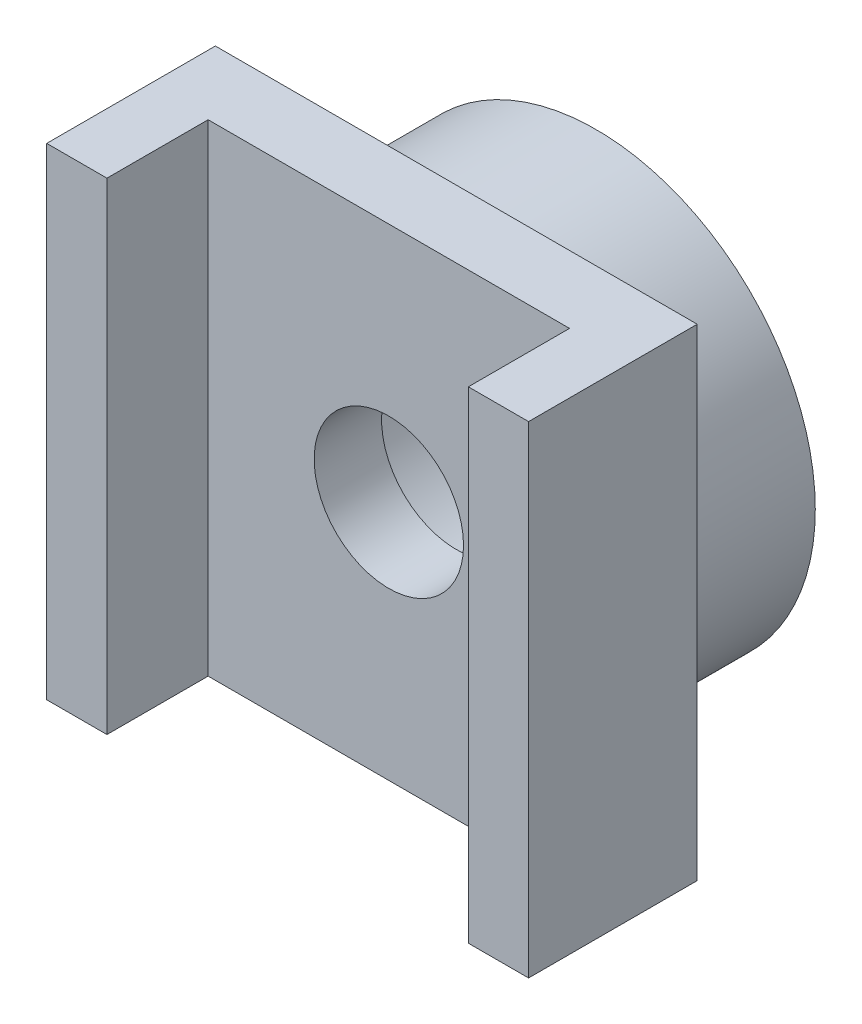
ISO-10303-21;
HEADER;
FILE_DESCRIPTION(('STEP AP214'),'2;1');
FILE_NAME('part.step','',(''),(''),'','','');
FILE_SCHEMA(('AUTOMOTIVE_DESIGN { 1 0 10303 214 1 1 1 1 }'));
ENDSEC;
DATA;
#1=APPLICATION_CONTEXT('core data for automotive mechanical design processes');
#2=APPLICATION_PROTOCOL_DEFINITION('international standard','automotive_design',2000,#1);
#3=PRODUCT_CONTEXT('',#1,'mechanical');
#4=PRODUCT('Part','Part','',(#3));
#5=PRODUCT_RELATED_PRODUCT_CATEGORY('part','',(#4));
#6=PRODUCT_DEFINITION_FORMATION('','',#4);
#7=PRODUCT_DEFINITION_CONTEXT('part definition',#1,'design');
#8=PRODUCT_DEFINITION('design','',#6,#7);
#9=PRODUCT_DEFINITION_SHAPE('','',#8);
#10=(LENGTH_UNIT() NAMED_UNIT(*) SI_UNIT(.MILLI.,.METRE.));
#11=(NAMED_UNIT(*) PLANE_ANGLE_UNIT() SI_UNIT($,.RADIAN.));
#12=(NAMED_UNIT(*) SI_UNIT($,.STERADIAN.) SOLID_ANGLE_UNIT());
#13=UNCERTAINTY_MEASURE_WITH_UNIT(LENGTH_MEASURE(1.E-05),#10,'distance_accuracy_value','');
#14=(GEOMETRIC_REPRESENTATION_CONTEXT(3) GLOBAL_UNCERTAINTY_ASSIGNED_CONTEXT((#13)) GLOBAL_UNIT_ASSIGNED_CONTEXT((#10,
#11,#12)) REPRESENTATION_CONTEXT('',''));
#15=CARTESIAN_POINT('',(0.,0.,0.));
#16=DIRECTION('',(0.,0.,1.));
#17=DIRECTION('',(1.,0.,0.));
#18=AXIS2_PLACEMENT_3D('',#15,#16,#17);
#19=CARTESIAN_POINT('',(0.,0.,0.));
#20=DIRECTION('',(0.,0.,1.));
#21=DIRECTION('',(1.,0.,0.));
#22=AXIS2_PLACEMENT_3D('',#19,#20,#21);
#23=PLANE('',#22);
#24=CARTESIAN_POINT('',(0.,0.,0.));
#25=DIRECTION('',(0.,0.,1.));
#26=DIRECTION('',(1.,0.,0.));
#27=AXIS2_PLACEMENT_3D('',#24,#25,#26);
#28=CIRCLE('',#27,4.55);
#29=CARTESIAN_POINT('',(4.55,0.,0.));
#30=VERTEX_POINT('',#29);
#31=EDGE_CURVE('E41',#30,#30,#28,.T.);
#32=ORIENTED_EDGE('',*,*,#31,.F.);
#33=EDGE_LOOP('',(#32));
#34=FACE_BOUND('',#33,.T.);
#35=CARTESIAN_POINT('',(0.,0.,0.));
#36=DIRECTION('',(0.,0.,1.));
#37=DIRECTION('',(1.,0.,0.));
#38=AXIS2_PLACEMENT_3D('',#35,#36,#37);
#39=CIRCLE('',#38,2.8);
#40=CARTESIAN_POINT('',(2.8,0.,0.));
#41=VERTEX_POINT('',#40);
#42=EDGE_CURVE('E184',#41,#41,#39,.T.);
#43=ORIENTED_EDGE('',*,*,#42,.T.);
#44=EDGE_LOOP('',(#43));
#45=FACE_BOUND('',#44,.T.);
#46=ADVANCED_FACE('F32',(#34,#45),#23,.F.);
#47=CARTESIAN_POINT('',(0.,0.,2.9));
#48=DIRECTION('',(0.,0.,-1.));
#49=DIRECTION('',(-1.,0.,0.));
#50=AXIS2_PLACEMENT_3D('',#47,#48,#49);
#51=CYLINDRICAL_SURFACE('',#50,4.55);
#52=CARTESIAN_POINT('',(0.,0.,2.9));
#53=DIRECTION('',(0.,0.,1.));
#54=DIRECTION('',(1.,0.,0.));
#55=AXIS2_PLACEMENT_3D('',#52,#53,#54);
#56=CIRCLE('',#55,4.55);
#57=CARTESIAN_POINT('',(4.55,0.,2.9));
#58=VERTEX_POINT('',#57);
#59=EDGE_CURVE('E11',#58,#58,#56,.T.);
#60=ORIENTED_EDGE('',*,*,#59,.F.);
#61=EDGE_LOOP('',(#60));
#62=FACE_BOUND('',#61,.T.);
#63=ORIENTED_EDGE('',*,*,#31,.T.);
#64=EDGE_LOOP('',(#63));
#65=FACE_BOUND('',#64,.T.);
#66=ADVANCED_FACE('F34',(#62,#65),#51,.T.);
#67=CARTESIAN_POINT('',(0.,0.,2.9));
#68=DIRECTION('',(0.,0.,-1.));
#69=DIRECTION('',(-1.,0.,0.));
#70=AXIS2_PLACEMENT_3D('',#67,#68,#69);
#71=CYLINDRICAL_SURFACE('',#70,2.8);
#72=CARTESIAN_POINT('',(0.,0.,2.9));
#73=DIRECTION('',(0.,0.,1.));
#74=DIRECTION('',(1.,0.,0.));
#75=AXIS2_PLACEMENT_3D('',#72,#73,#74);
#76=CIRCLE('',#75,2.8);
#77=CARTESIAN_POINT('',(2.8,0.,2.9));
#78=VERTEX_POINT('',#77);
#79=EDGE_CURVE('E181',#78,#78,#76,.T.);
#80=ORIENTED_EDGE('',*,*,#79,.T.);
#81=EDGE_LOOP('',(#80));
#82=FACE_BOUND('',#81,.T.);
#83=ORIENTED_EDGE('',*,*,#42,.F.);
#84=EDGE_LOOP('',(#83));
#85=FACE_BOUND('',#84,.T.);
#86=ADVANCED_FACE('F216',(#82,#85),#71,.F.);
#87=CARTESIAN_POINT('',(0.,-11.1414213562373,2.9));
#88=DIRECTION('',(0.,0.,1.));
#89=DIRECTION('',(1.,0.,0.));
#90=AXIS2_PLACEMENT_3D('',#87,#88,#89);
#91=PLANE('',#90);
#92=DIRECTION('',(1.,0.,0.));
#93=VECTOR('',#92,1.);
#94=CARTESIAN_POINT('',(0.,-5.,2.9));
#95=LINE('',#94,#93);
#96=CARTESIAN_POINT('',(-5.,-5.,2.9));
#97=VERTEX_POINT('',#96);
#98=CARTESIAN_POINT('',(5.,-5.,2.9));
#99=VERTEX_POINT('',#98);
#100=EDGE_CURVE('E155',#97,#99,#95,.T.);
#101=ORIENTED_EDGE('',*,*,#100,.F.);
#102=DIRECTION('',(0.,1.,0.));
#103=VECTOR('',#102,1.);
#104=CARTESIAN_POINT('',(-5.,-11.1414213562373,2.9));
#105=LINE('',#104,#103);
#106=CARTESIAN_POINT('',(-5.,5.,2.9));
#107=VERTEX_POINT('',#106);
#108=EDGE_CURVE('E168',#97,#107,#105,.T.);
#109=ORIENTED_EDGE('',*,*,#108,.T.);
#110=DIRECTION('',(1.,0.,0.));
#111=VECTOR('',#110,1.);
#112=CARTESIAN_POINT('',(0.,5.,2.9));
#113=LINE('',#112,#111);
#114=CARTESIAN_POINT('',(5.,5.,2.9));
#115=VERTEX_POINT('',#114);
#116=EDGE_CURVE('E161',#107,#115,#113,.T.);
#117=ORIENTED_EDGE('',*,*,#116,.T.);
#118=DIRECTION('',(0.,1.,0.));
#119=VECTOR('',#118,1.);
#120=CARTESIAN_POINT('',(5.,-11.1414213562373,2.9));
#121=LINE('',#120,#119);
#122=EDGE_CURVE('E158',#99,#115,#121,.T.);
#123=ORIENTED_EDGE('',*,*,#122,.F.);
#124=EDGE_LOOP('',(#101,#109,#117,#123));
#125=FACE_BOUND('',#124,.T.);
#126=ORIENTED_EDGE('',*,*,#59,.T.);
#127=EDGE_LOOP('',(#126));
#128=FACE_BOUND('',#127,.T.);
#129=ADVANCED_FACE('F207',(#125,#128),#91,.F.);
#130=CARTESIAN_POINT('',(0.,-5.,4.3));
#131=DIRECTION('',(0.,1.,0.));
#132=DIRECTION('',(0.,0.,1.));
#133=AXIS2_PLACEMENT_3D('',#130,#131,#132);
#134=PLANE('',#133);
#135=ORIENTED_EDGE('',*,*,#100,.T.);
#136=DIRECTION('',(0.,0.,-1.));
#137=VECTOR('',#136,1.);
#138=CARTESIAN_POINT('',(5.,-5.,4.3));
#139=LINE('',#138,#137);
#140=CARTESIAN_POINT('',(5.,-5.,6.4));
#141=VERTEX_POINT('',#140);
#142=EDGE_CURVE('E122',#141,#99,#139,.T.);
#143=ORIENTED_EDGE('',*,*,#142,.F.);
#144=DIRECTION('',(-1.,0.,0.));
#145=VECTOR('',#144,1.);
#146=CARTESIAN_POINT('',(-11.1414213562373,-5.,6.4));
#147=LINE('',#146,#145);
#148=CARTESIAN_POINT('',(3.75,-5.,6.4));
#149=VERTEX_POINT('',#148);
#150=EDGE_CURVE('E114',#141,#149,#147,.T.);
#151=ORIENTED_EDGE('',*,*,#150,.T.);
#152=DIRECTION('',(0.,0.,-1.));
#153=VECTOR('',#152,1.);
#154=CARTESIAN_POINT('',(3.75,-5.,6.4));
#155=LINE('',#154,#153);
#156=CARTESIAN_POINT('',(3.75,-5.,4.3));
#157=VERTEX_POINT('',#156);
#158=EDGE_CURVE('E101',#149,#157,#155,.T.);
#159=ORIENTED_EDGE('',*,*,#158,.T.);
#160=DIRECTION('',(1.,0.,0.));
#161=VECTOR('',#160,1.);
#162=CARTESIAN_POINT('',(0.,-5.,4.3));
#163=LINE('',#162,#161);
#164=CARTESIAN_POINT('',(-3.75,-5.,4.3));
#165=VERTEX_POINT('',#164);
#166=EDGE_CURVE('E174',#165,#157,#163,.T.);
#167=ORIENTED_EDGE('',*,*,#166,.F.);
#168=DIRECTION('',(0.,0.,-1.));
#169=VECTOR('',#168,1.);
#170=CARTESIAN_POINT('',(-3.75,-5.,6.4));
#171=LINE('',#170,#169);
#172=CARTESIAN_POINT('',(-3.75,-5.,6.4));
#173=VERTEX_POINT('',#172);
#174=EDGE_CURVE('E152',#173,#165,#171,.T.);
#175=ORIENTED_EDGE('',*,*,#174,.F.);
#176=DIRECTION('',(-1.,0.,0.));
#177=VECTOR('',#176,1.);
#178=CARTESIAN_POINT('',(-11.1414213562373,-5.,6.4));
#179=LINE('',#178,#177);
#180=CARTESIAN_POINT('',(-5.,-5.,6.4));
#181=VERTEX_POINT('',#180);
#182=EDGE_CURVE('E130',#173,#181,#179,.T.);
#183=ORIENTED_EDGE('',*,*,#182,.T.);
#184=DIRECTION('',(0.,0.,-1.));
#185=VECTOR('',#184,1.);
#186=CARTESIAN_POINT('',(-5.,-5.,4.3));
#187=LINE('',#186,#185);
#188=EDGE_CURVE('E57',#181,#97,#187,.T.);
#189=ORIENTED_EDGE('',*,*,#188,.T.);
#190=EDGE_LOOP('',(#135,#143,#151,#159,#167,#175,#183,#189));
#191=FACE_BOUND('',#190,.T.);
#192=ADVANCED_FACE('F120',(#191),#134,.F.);
#193=CARTESIAN_POINT('',(5.,-11.1414213562373,4.3));
#194=DIRECTION('',(-1.,0.,0.));
#195=DIRECTION('',(0.,0.,1.));
#196=AXIS2_PLACEMENT_3D('',#193,#194,#195);
#197=PLANE('',#196);
#198=ORIENTED_EDGE('',*,*,#122,.T.);
#199=DIRECTION('',(0.,0.,-1.));
#200=VECTOR('',#199,1.);
#201=CARTESIAN_POINT('',(5.,5.,4.3));
#202=LINE('',#201,#200);
#203=CARTESIAN_POINT('',(5.,5.,6.4));
#204=VERTEX_POINT('',#203);
#205=EDGE_CURVE('E178',#204,#115,#202,.T.);
#206=ORIENTED_EDGE('',*,*,#205,.F.);
#207=DIRECTION('',(0.,-1.,0.));
#208=VECTOR('',#207,1.);
#209=CARTESIAN_POINT('',(5.,0.,6.4));
#210=LINE('',#209,#208);
#211=EDGE_CURVE('E123',#204,#141,#210,.T.);
#212=ORIENTED_EDGE('',*,*,#211,.T.);
#213=ORIENTED_EDGE('',*,*,#142,.T.);
#214=EDGE_LOOP('',(#198,#206,#212,#213));
#215=FACE_BOUND('',#214,.T.);
#216=ADVANCED_FACE('F226',(#215),#197,.F.);
#217=CARTESIAN_POINT('',(0.,5.,4.3));
#218=DIRECTION('',(0.,1.,0.));
#219=DIRECTION('',(0.,0.,1.));
#220=AXIS2_PLACEMENT_3D('',#217,#218,#219);
#221=PLANE('',#220);
#222=ORIENTED_EDGE('',*,*,#116,.F.);
#223=DIRECTION('',(0.,0.,-1.));
#224=VECTOR('',#223,1.);
#225=CARTESIAN_POINT('',(-5.,5.,4.3));
#226=LINE('',#225,#224);
#227=CARTESIAN_POINT('',(-5.,5.,6.4));
#228=VERTEX_POINT('',#227);
#229=EDGE_CURVE('E176',#228,#107,#226,.T.);
#230=ORIENTED_EDGE('',*,*,#229,.F.);
#231=DIRECTION('',(-1.,0.,0.));
#232=VECTOR('',#231,1.);
#233=CARTESIAN_POINT('',(-11.1414213562373,5.,6.4));
#234=LINE('',#233,#232);
#235=CARTESIAN_POINT('',(-3.75,5.,6.4));
#236=VERTEX_POINT('',#235);
#237=EDGE_CURVE('E134',#236,#228,#234,.T.);
#238=ORIENTED_EDGE('',*,*,#237,.F.);
#239=DIRECTION('',(0.,0.,-1.));
#240=VECTOR('',#239,1.);
#241=CARTESIAN_POINT('',(-3.75,5.,6.4));
#242=LINE('',#241,#240);
#243=CARTESIAN_POINT('',(-3.75,5.,4.3));
#244=VERTEX_POINT('',#243);
#245=EDGE_CURVE('E140',#236,#244,#242,.T.);
#246=ORIENTED_EDGE('',*,*,#245,.T.);
#247=DIRECTION('',(1.,0.,0.));
#248=VECTOR('',#247,1.);
#249=CARTESIAN_POINT('',(0.,5.,4.3));
#250=LINE('',#249,#248);
#251=CARTESIAN_POINT('',(3.75,5.,4.3));
#252=VERTEX_POINT('',#251);
#253=EDGE_CURVE('E148',#244,#252,#250,.T.);
#254=ORIENTED_EDGE('',*,*,#253,.T.);
#255=DIRECTION('',(0.,0.,-1.));
#256=VECTOR('',#255,1.);
#257=CARTESIAN_POINT('',(3.75,5.,6.4));
#258=LINE('',#257,#256);
#259=CARTESIAN_POINT('',(3.75,5.,6.4));
#260=VERTEX_POINT('',#259);
#261=EDGE_CURVE('E108',#260,#252,#258,.T.);
#262=ORIENTED_EDGE('',*,*,#261,.F.);
#263=DIRECTION('',(-1.,0.,0.));
#264=VECTOR('',#263,1.);
#265=CARTESIAN_POINT('',(-11.1414213562373,5.,6.4));
#266=LINE('',#265,#264);
#267=EDGE_CURVE('E117',#204,#260,#266,.T.);
#268=ORIENTED_EDGE('',*,*,#267,.F.);
#269=ORIENTED_EDGE('',*,*,#205,.T.);
#270=EDGE_LOOP('',(#222,#230,#238,#246,#254,#262,#268,#269));
#271=FACE_BOUND('',#270,.T.);
#272=ADVANCED_FACE('F229',(#271),#221,.T.);
#273=CARTESIAN_POINT('',(-5.,-11.1414213562373,4.3));
#274=DIRECTION('',(-1.,0.,0.));
#275=DIRECTION('',(0.,0.,1.));
#276=AXIS2_PLACEMENT_3D('',#273,#274,#275);
#277=PLANE('',#276);
#278=ORIENTED_EDGE('',*,*,#108,.F.);
#279=ORIENTED_EDGE('',*,*,#188,.F.);
#280=DIRECTION('',(0.,-1.,0.));
#281=VECTOR('',#280,1.);
#282=CARTESIAN_POINT('',(-5.,0.,6.4));
#283=LINE('',#282,#281);
#284=EDGE_CURVE('E137',#228,#181,#283,.T.);
#285=ORIENTED_EDGE('',*,*,#284,.F.);
#286=ORIENTED_EDGE('',*,*,#229,.T.);
#287=EDGE_LOOP('',(#278,#279,#285,#286));
#288=FACE_BOUND('',#287,.T.);
#289=ADVANCED_FACE('F208',(#288),#277,.T.);
#290=CARTESIAN_POINT('',(0.,0.,4.3));
#291=DIRECTION('',(0.,0.,-1.));
#292=DIRECTION('',(-1.,0.,0.));
#293=AXIS2_PLACEMENT_3D('',#290,#291,#292);
#294=CYLINDRICAL_SURFACE('',#293,1.55);
#295=CARTESIAN_POINT('',(0.,0.,4.3));
#296=DIRECTION('',(0.,0.,1.));
#297=DIRECTION('',(1.,0.,0.));
#298=AXIS2_PLACEMENT_3D('',#295,#296,#297);
#299=CIRCLE('',#298,1.55);
#300=CARTESIAN_POINT('',(1.55,0.,4.3));
#301=VERTEX_POINT('',#300);
#302=EDGE_CURVE('E164',#301,#301,#299,.T.);
#303=ORIENTED_EDGE('',*,*,#302,.T.);
#304=EDGE_LOOP('',(#303));
#305=FACE_BOUND('',#304,.T.);
#306=CARTESIAN_POINT('',(0.,0.,2.9));
#307=DIRECTION('',(0.,0.,1.));
#308=DIRECTION('',(1.,0.,0.));
#309=AXIS2_PLACEMENT_3D('',#306,#307,#308);
#310=CIRCLE('',#309,1.55);
#311=CARTESIAN_POINT('',(1.55,0.,2.9));
#312=VERTEX_POINT('',#311);
#313=EDGE_CURVE('E171',#312,#312,#310,.T.);
#314=ORIENTED_EDGE('',*,*,#313,.F.);
#315=EDGE_LOOP('',(#314));
#316=FACE_BOUND('',#315,.T.);
#317=ADVANCED_FACE('F193',(#305,#316),#294,.F.);
#318=CARTESIAN_POINT('',(0.,-11.1414213562373,4.3));
#319=DIRECTION('',(0.,0.,1.));
#320=DIRECTION('',(1.,0.,0.));
#321=AXIS2_PLACEMENT_3D('',#318,#319,#320);
#322=PLANE('',#321);
#323=DIRECTION('',(0.,1.,0.));
#324=VECTOR('',#323,1.);
#325=CARTESIAN_POINT('',(3.75,0.,4.3));
#326=LINE('',#325,#324);
#327=EDGE_CURVE('E106',#157,#252,#326,.T.);
#328=ORIENTED_EDGE('',*,*,#327,.T.);
#329=ORIENTED_EDGE('',*,*,#253,.F.);
#330=DIRECTION('',(0.,1.,0.));
#331=VECTOR('',#330,1.);
#332=CARTESIAN_POINT('',(-3.75,0.,4.3));
#333=LINE('',#332,#331);
#334=EDGE_CURVE('E49',#165,#244,#333,.T.);
#335=ORIENTED_EDGE('',*,*,#334,.F.);
#336=ORIENTED_EDGE('',*,*,#166,.T.);
#337=EDGE_LOOP('',(#328,#329,#335,#336));
#338=FACE_BOUND('',#337,.T.);
#339=ORIENTED_EDGE('',*,*,#302,.F.);
#340=EDGE_LOOP('',(#339));
#341=FACE_BOUND('',#340,.T.);
#342=ADVANCED_FACE('F196',(#338,#341),#322,.T.);
#343=ORIENTED_EDGE('',*,*,#79,.F.);
#344=EDGE_LOOP('',(#343));
#345=FACE_BOUND('',#344,.T.);
#346=ORIENTED_EDGE('',*,*,#313,.T.);
#347=EDGE_LOOP('',(#346));
#348=FACE_BOUND('',#347,.T.);
#349=ADVANCED_FACE('F198',(#345,#348),#91,.F.);
#350=CARTESIAN_POINT('',(-3.75,0.,6.4));
#351=DIRECTION('',(-1.,0.,0.));
#352=DIRECTION('',(0.,-1.,0.));
#353=AXIS2_PLACEMENT_3D('',#350,#351,#352);
#354=PLANE('',#353);
#355=ORIENTED_EDGE('',*,*,#334,.T.);
#356=ORIENTED_EDGE('',*,*,#245,.F.);
#357=DIRECTION('',(0.,1.,0.));
#358=VECTOR('',#357,1.);
#359=CARTESIAN_POINT('',(-3.75,0.,6.4));
#360=LINE('',#359,#358);
#361=EDGE_CURVE('E132',#173,#236,#360,.T.);
#362=ORIENTED_EDGE('',*,*,#361,.F.);
#363=ORIENTED_EDGE('',*,*,#174,.T.);
#364=EDGE_LOOP('',(#355,#356,#362,#363));
#365=FACE_BOUND('',#364,.T.);
#366=ADVANCED_FACE('F204',(#365),#354,.F.);
#367=CARTESIAN_POINT('',(-11.1414213562373,0.,6.4));
#368=DIRECTION('',(0.,0.,-1.));
#369=DIRECTION('',(-1.,0.,0.));
#370=AXIS2_PLACEMENT_3D('',#367,#368,#369);
#371=PLANE('',#370);
#372=ORIENTED_EDGE('',*,*,#182,.F.);
#373=ORIENTED_EDGE('',*,*,#361,.T.);
#374=ORIENTED_EDGE('',*,*,#237,.T.);
#375=ORIENTED_EDGE('',*,*,#284,.T.);
#376=EDGE_LOOP('',(#372,#373,#374,#375));
#377=FACE_BOUND('',#376,.T.);
#378=ADVANCED_FACE('F246',(#377),#371,.F.);
#379=CARTESIAN_POINT('',(3.75,0.,6.4));
#380=DIRECTION('',(-1.,0.,0.));
#381=DIRECTION('',(0.,-1.,0.));
#382=AXIS2_PLACEMENT_3D('',#379,#380,#381);
#383=PLANE('',#382);
#384=ORIENTED_EDGE('',*,*,#327,.F.);
#385=ORIENTED_EDGE('',*,*,#158,.F.);
#386=DIRECTION('',(0.,1.,0.));
#387=VECTOR('',#386,1.);
#388=CARTESIAN_POINT('',(3.75,0.,6.4));
#389=LINE('',#388,#387);
#390=EDGE_CURVE('E104',#149,#260,#389,.T.);
#391=ORIENTED_EDGE('',*,*,#390,.T.);
#392=ORIENTED_EDGE('',*,*,#261,.T.);
#393=EDGE_LOOP('',(#384,#385,#391,#392));
#394=FACE_BOUND('',#393,.T.);
#395=ADVANCED_FACE('F103',(#394),#383,.T.);
#396=CARTESIAN_POINT('',(-11.1414213562373,0.,6.4));
#397=DIRECTION('',(0.,0.,-1.));
#398=DIRECTION('',(-1.,0.,0.));
#399=AXIS2_PLACEMENT_3D('',#396,#397,#398);
#400=PLANE('',#399);
#401=ORIENTED_EDGE('',*,*,#390,.F.);
#402=ORIENTED_EDGE('',*,*,#150,.F.);
#403=ORIENTED_EDGE('',*,*,#211,.F.);
#404=ORIENTED_EDGE('',*,*,#267,.T.);
#405=EDGE_LOOP('',(#401,#402,#403,#404));
#406=FACE_BOUND('',#405,.T.);
#407=ADVANCED_FACE('F112',(#406),#400,.F.);
#408=CLOSED_SHELL('',(#46,#66,#86,#129,#192,#216,#272,#289,#317,#342,#349,#366,#378,#395,#407));
#409=MANIFOLD_SOLID_BREP('B2',#408);
#410=ADVANCED_BREP_SHAPE_REPRESENTATION('',(#18,#409),#14);
#411=SHAPE_DEFINITION_REPRESENTATION(#9,#410);
ENDSEC;
END-ISO-10303-21;
